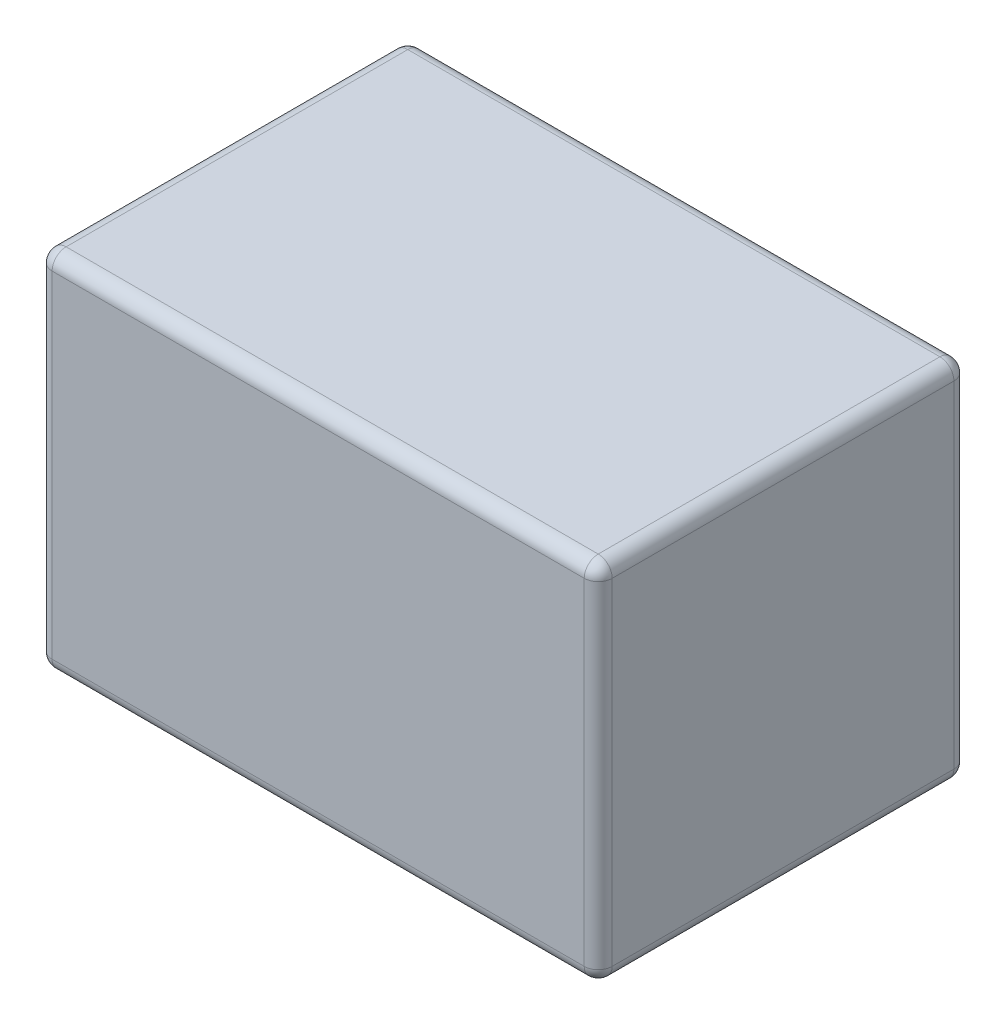
ISO-10303-21;
HEADER;
FILE_DESCRIPTION(('STEP AP214'),'2;1');
FILE_NAME('part.step','',(''),(''),'','','');
FILE_SCHEMA(('AUTOMOTIVE_DESIGN { 1 0 10303 214 1 1 1 1 }'));
ENDSEC;
DATA;
#1=APPLICATION_CONTEXT('core data for automotive mechanical design processes');
#2=APPLICATION_PROTOCOL_DEFINITION('international standard','automotive_design',2000,#1);
#3=PRODUCT_CONTEXT('',#1,'mechanical');
#4=PRODUCT('Part','Part','',(#3));
#5=PRODUCT_RELATED_PRODUCT_CATEGORY('part','',(#4));
#6=PRODUCT_DEFINITION_FORMATION('','',#4);
#7=PRODUCT_DEFINITION_CONTEXT('part definition',#1,'design');
#8=PRODUCT_DEFINITION('design','',#6,#7);
#9=PRODUCT_DEFINITION_SHAPE('','',#8);
#10=(LENGTH_UNIT() NAMED_UNIT(*) SI_UNIT(.MILLI.,.METRE.));
#11=(NAMED_UNIT(*) PLANE_ANGLE_UNIT() SI_UNIT($,.RADIAN.));
#12=(NAMED_UNIT(*) SI_UNIT($,.STERADIAN.) SOLID_ANGLE_UNIT());
#13=UNCERTAINTY_MEASURE_WITH_UNIT(LENGTH_MEASURE(1.E-05),#10,'distance_accuracy_value','');
#14=(GEOMETRIC_REPRESENTATION_CONTEXT(3) GLOBAL_UNCERTAINTY_ASSIGNED_CONTEXT((#13)) GLOBAL_UNIT_ASSIGNED_CONTEXT((#10,
#11,#12)) REPRESENTATION_CONTEXT('',''));
#15=CARTESIAN_POINT('',(0.,0.,0.));
#16=DIRECTION('',(0.,0.,1.));
#17=DIRECTION('',(1.,0.,0.));
#18=AXIS2_PLACEMENT_3D('',#15,#16,#17);
#19=CARTESIAN_POINT('',(0.,45.3224767930072,132.));
#20=DIRECTION('',(0.,1.,0.));
#21=DIRECTION('',(0.,0.,1.));
#22=AXIS2_PLACEMENT_3D('',#19,#20,#21);
#23=PLANE('',#22);
#24=DIRECTION('',(1.,0.,0.));
#25=VECTOR('',#24,1.);
#26=CARTESIAN_POINT('',(-68.5655747312052,45.3224767930072,5.));
#27=LINE('',#26,#25);
#28=CARTESIAN_POINT('',(126.434425268795,45.3224767930072,5.));
#29=VERTEX_POINT('',#28);
#30=CARTESIAN_POINT('',(-63.5655747312052,45.3224767930072,5.));
#31=VERTEX_POINT('',#30);
#32=EDGE_CURVE('E201',#29,#31,#27,.F.);
#33=ORIENTED_EDGE('',*,*,#32,.T.);
#34=DIRECTION('',(0.,0.,-1.));
#35=VECTOR('',#34,1.);
#36=CARTESIAN_POINT('',(-63.5655747312052,45.3224767930072,132.));
#37=LINE('',#36,#35);
#38=CARTESIAN_POINT('',(-63.5655747312052,45.3224767930072,127.));
#39=VERTEX_POINT('',#38);
#40=EDGE_CURVE('E203',#31,#39,#37,.F.);
#41=ORIENTED_EDGE('',*,*,#40,.T.);
#42=DIRECTION('',(1.,0.,0.));
#43=VECTOR('',#42,1.);
#44=CARTESIAN_POINT('',(0.,45.3224767930072,127.));
#45=LINE('',#44,#43);
#46=CARTESIAN_POINT('',(126.434425268795,45.3224767930072,127.));
#47=VERTEX_POINT('',#46);
#48=EDGE_CURVE('E197',#39,#47,#45,.T.);
#49=ORIENTED_EDGE('',*,*,#48,.T.);
#50=DIRECTION('',(0.,0.,-1.));
#51=VECTOR('',#50,1.);
#52=CARTESIAN_POINT('',(126.434425268795,45.3224767930072,132.));
#53=LINE('',#52,#51);
#54=EDGE_CURVE('E199',#47,#29,#53,.T.);
#55=ORIENTED_EDGE('',*,*,#54,.T.);
#56=EDGE_LOOP('',(#33,#41,#49,#55));
#57=FACE_BOUND('',#56,.T.);
#58=ADVANCED_FACE('F35',(#57),#23,.T.);
#59=CARTESIAN_POINT('',(-68.5655747312052,0.,132.));
#60=DIRECTION('',(1.,0.,0.));
#61=DIRECTION('',(0.,1.,0.));
#62=AXIS2_PLACEMENT_3D('',#59,#60,#61);
#63=PLANE('',#62);
#64=DIRECTION('',(0.,-1.,0.));
#65=VECTOR('',#64,1.);
#66=CARTESIAN_POINT('',(-68.5655747312052,0.,5.));
#67=LINE('',#66,#65);
#68=CARTESIAN_POINT('',(-68.5655747312052,40.3224767930072,5.));
#69=VERTEX_POINT('',#68);
#70=CARTESIAN_POINT('',(-68.5655747312052,-79.6775232069929,5.));
#71=VERTEX_POINT('',#70);
#72=EDGE_CURVE('E192',#69,#71,#67,.T.);
#73=ORIENTED_EDGE('',*,*,#72,.T.);
#74=DIRECTION('',(0.,0.,-1.));
#75=VECTOR('',#74,1.);
#76=CARTESIAN_POINT('',(-68.5655747312052,-79.6775232069929,132.));
#77=LINE('',#76,#75);
#78=CARTESIAN_POINT('',(-68.5655747312052,-79.6775232069929,127.));
#79=VERTEX_POINT('',#78);
#80=EDGE_CURVE('E194',#71,#79,#77,.F.);
#81=ORIENTED_EDGE('',*,*,#80,.T.);
#82=DIRECTION('',(0.,-1.,0.));
#83=VECTOR('',#82,1.);
#84=CARTESIAN_POINT('',(-68.5655747312052,45.3224767930072,127.));
#85=LINE('',#84,#83);
#86=CARTESIAN_POINT('',(-68.5655747312052,40.3224767930072,127.));
#87=VERTEX_POINT('',#86);
#88=EDGE_CURVE('E188',#79,#87,#85,.F.);
#89=ORIENTED_EDGE('',*,*,#88,.T.);
#90=DIRECTION('',(0.,0.,-1.));
#91=VECTOR('',#90,1.);
#92=CARTESIAN_POINT('',(-68.5655747312052,40.3224767930072,0.));
#93=LINE('',#92,#91);
#94=EDGE_CURVE('E190',#87,#69,#93,.T.);
#95=ORIENTED_EDGE('',*,*,#94,.T.);
#96=EDGE_LOOP('',(#73,#81,#89,#95));
#97=FACE_BOUND('',#96,.T.);
#98=ADVANCED_FACE('F385',(#97),#63,.F.);
#99=CARTESIAN_POINT('',(0.,-84.6775232069929,132.));
#100=DIRECTION('',(0.,-1.,0.));
#101=DIRECTION('',(1.,0.,0.));
#102=AXIS2_PLACEMENT_3D('',#99,#100,#101);
#103=PLANE('',#102);
#104=DIRECTION('',(0.,0.,-1.));
#105=VECTOR('',#104,1.);
#106=CARTESIAN_POINT('',(-63.5655747312052,-84.6775232069929,0.));
#107=LINE('',#106,#105);
#108=CARTESIAN_POINT('',(-63.5655747312052,-84.6775232069929,127.));
#109=VERTEX_POINT('',#108);
#110=CARTESIAN_POINT('',(-63.5655747312052,-84.6775232069929,5.));
#111=VERTEX_POINT('',#110);
#112=EDGE_CURVE('E183',#109,#111,#107,.T.);
#113=ORIENTED_EDGE('',*,*,#112,.T.);
#114=DIRECTION('',(-1.,0.,0.));
#115=VECTOR('',#114,1.);
#116=CARTESIAN_POINT('',(131.434425268795,-84.6775232069928,5.));
#117=LINE('',#116,#115);
#118=CARTESIAN_POINT('',(126.434425268795,-84.6775232069928,5.));
#119=VERTEX_POINT('',#118);
#120=EDGE_CURVE('E185',#111,#119,#117,.F.);
#121=ORIENTED_EDGE('',*,*,#120,.T.);
#122=DIRECTION('',(0.,0.,-1.));
#123=VECTOR('',#122,1.);
#124=CARTESIAN_POINT('',(126.434425268795,-84.6775232069928,132.));
#125=LINE('',#124,#123);
#126=CARTESIAN_POINT('',(126.434425268795,-84.6775232069928,127.));
#127=VERTEX_POINT('',#126);
#128=EDGE_CURVE('E181',#119,#127,#125,.F.);
#129=ORIENTED_EDGE('',*,*,#128,.T.);
#130=DIRECTION('',(-1.,0.,0.));
#131=VECTOR('',#130,1.);
#132=CARTESIAN_POINT('',(0.,-84.6775232069929,127.));
#133=LINE('',#132,#131);
#134=EDGE_CURVE('E179',#127,#109,#133,.T.);
#135=ORIENTED_EDGE('',*,*,#134,.T.);
#136=EDGE_LOOP('',(#113,#121,#129,#135));
#137=FACE_BOUND('',#136,.T.);
#138=ADVANCED_FACE('F346',(#137),#103,.T.);
#139=CARTESIAN_POINT('',(131.434425268795,0.,132.));
#140=DIRECTION('',(1.,0.,0.));
#141=DIRECTION('',(0.,1.,0.));
#142=AXIS2_PLACEMENT_3D('',#139,#140,#141);
#143=PLANE('',#142);
#144=DIRECTION('',(0.,0.,-1.));
#145=VECTOR('',#144,1.);
#146=CARTESIAN_POINT('',(131.434425268795,-79.6775232069928,132.));
#147=LINE('',#146,#145);
#148=CARTESIAN_POINT('',(131.434425268795,-79.6775232069928,127.));
#149=VERTEX_POINT('',#148);
#150=CARTESIAN_POINT('',(131.434425268795,-79.6775232069928,5.));
#151=VERTEX_POINT('',#150);
#152=EDGE_CURVE('E210',#149,#151,#147,.T.);
#153=ORIENTED_EDGE('',*,*,#152,.T.);
#154=DIRECTION('',(0.,-1.,0.));
#155=VECTOR('',#154,1.);
#156=CARTESIAN_POINT('',(131.434425268795,45.3224767930072,5.));
#157=LINE('',#156,#155);
#158=CARTESIAN_POINT('',(131.434425268795,40.3224767930072,5.));
#159=VERTEX_POINT('',#158);
#160=EDGE_CURVE('E213',#151,#159,#157,.F.);
#161=ORIENTED_EDGE('',*,*,#160,.T.);
#162=DIRECTION('',(0.,0.,-1.));
#163=VECTOR('',#162,1.);
#164=CARTESIAN_POINT('',(131.434425268795,40.3224767930072,132.));
#165=LINE('',#164,#163);
#166=CARTESIAN_POINT('',(131.434425268795,40.3224767930072,127.));
#167=VERTEX_POINT('',#166);
#168=EDGE_CURVE('E208',#159,#167,#165,.F.);
#169=ORIENTED_EDGE('',*,*,#168,.T.);
#170=DIRECTION('',(0.,-1.,0.));
#171=VECTOR('',#170,1.);
#172=CARTESIAN_POINT('',(131.434425268795,0.,127.));
#173=LINE('',#172,#171);
#174=EDGE_CURVE('E206',#167,#149,#173,.T.);
#175=ORIENTED_EDGE('',*,*,#174,.T.);
#176=EDGE_LOOP('',(#153,#161,#169,#175));
#177=FACE_BOUND('',#176,.T.);
#178=ADVANCED_FACE('F312',(#177),#143,.T.);
#179=CARTESIAN_POINT('',(0.,0.,132.));
#180=DIRECTION('',(0.,0.,1.));
#181=DIRECTION('',(1.,0.,0.));
#182=AXIS2_PLACEMENT_3D('',#179,#180,#181);
#183=PLANE('',#182);
#184=DIRECTION('',(-1.,0.,0.));
#185=VECTOR('',#184,1.);
#186=CARTESIAN_POINT('',(0.,-79.6775232069929,132.));
#187=LINE('',#186,#185);
#188=CARTESIAN_POINT('',(-63.5655747312052,-79.6775232069929,132.));
#189=VERTEX_POINT('',#188);
#190=CARTESIAN_POINT('',(126.434425268795,-79.6775232069928,132.));
#191=VERTEX_POINT('',#190);
#192=EDGE_CURVE('E44',#189,#191,#187,.F.);
#193=ORIENTED_EDGE('',*,*,#192,.T.);
#194=DIRECTION('',(0.,-1.,0.));
#195=VECTOR('',#194,1.);
#196=CARTESIAN_POINT('',(126.434425268795,0.,132.));
#197=LINE('',#196,#195);
#198=CARTESIAN_POINT('',(126.434425268795,40.3224767930072,132.));
#199=VERTEX_POINT('',#198);
#200=EDGE_CURVE('E11',#191,#199,#197,.F.);
#201=ORIENTED_EDGE('',*,*,#200,.T.);
#202=DIRECTION('',(1.,0.,0.));
#203=VECTOR('',#202,1.);
#204=CARTESIAN_POINT('',(0.,40.3224767930072,132.));
#205=LINE('',#204,#203);
#206=CARTESIAN_POINT('',(-63.5655747312052,40.3224767930072,132.));
#207=VERTEX_POINT('',#206);
#208=EDGE_CURVE('E215',#199,#207,#205,.F.);
#209=ORIENTED_EDGE('',*,*,#208,.T.);
#210=DIRECTION('',(0.,-1.,0.));
#211=VECTOR('',#210,1.);
#212=CARTESIAN_POINT('',(-63.5655747312052,-84.6775232069929,132.));
#213=LINE('',#212,#211);
#214=EDGE_CURVE('E55',#207,#189,#213,.T.);
#215=ORIENTED_EDGE('',*,*,#214,.T.);
#216=EDGE_LOOP('',(#193,#201,#209,#215));
#217=FACE_BOUND('',#216,.T.);
#218=ADVANCED_FACE('F292',(#217),#183,.T.);
#219=CARTESIAN_POINT('',(0.,40.3224767930072,127.));
#220=DIRECTION('',(1.,0.,0.));
#221=DIRECTION('',(0.,0.,-1.));
#222=AXIS2_PLACEMENT_3D('',#219,#220,#221);
#223=CYLINDRICAL_SURFACE('',#222,5.);
#224=CARTESIAN_POINT('',(126.434425268795,40.3224767930072,127.));
#225=DIRECTION('',(1.,0.,0.));
#226=DIRECTION('',(0.,0.,-1.));
#227=AXIS2_PLACEMENT_3D('',#224,#225,#226);
#228=CIRCLE('',#227,5.);
#229=EDGE_CURVE('E39',#47,#199,#228,.T.);
#230=ORIENTED_EDGE('',*,*,#229,.F.);
#231=ORIENTED_EDGE('',*,*,#48,.F.);
#232=CARTESIAN_POINT('',(-63.5655747312052,40.3224767930072,127.));
#233=DIRECTION('',(-1.,0.,0.));
#234=DIRECTION('',(0.,0.,1.));
#235=AXIS2_PLACEMENT_3D('',#232,#233,#234);
#236=CIRCLE('',#235,5.);
#237=EDGE_CURVE('E275',#207,#39,#236,.T.);
#238=ORIENTED_EDGE('',*,*,#237,.F.);
#239=ORIENTED_EDGE('',*,*,#208,.F.);
#240=EDGE_LOOP('',(#230,#231,#238,#239));
#241=FACE_BOUND('',#240,.T.);
#242=ADVANCED_FACE('F37',(#241),#223,.T.);
#243=CARTESIAN_POINT('',(126.434425268795,40.3224767930072,127.));
#244=DIRECTION('',(0.,0.,1.));
#245=DIRECTION('',(1.,0.,0.));
#246=AXIS2_PLACEMENT_3D('',#243,#244,#245);
#247=SPHERICAL_SURFACE('',#246,5.);
#248=CARTESIAN_POINT('',(126.434425268795,40.3224767930072,127.));
#249=DIRECTION('',(0.,0.,1.));
#250=DIRECTION('',(1.,0.,0.));
#251=AXIS2_PLACEMENT_3D('',#248,#249,#250);
#252=CIRCLE('',#251,5.);
#253=EDGE_CURVE('E271',#47,#167,#252,.F.);
#254=ORIENTED_EDGE('',*,*,#253,.F.);
#255=ORIENTED_EDGE('',*,*,#229,.T.);
#256=CARTESIAN_POINT('',(126.434425268795,40.3224767930072,127.));
#257=DIRECTION('',(0.,1.,0.));
#258=DIRECTION('',(0.,0.,1.));
#259=AXIS2_PLACEMENT_3D('',#256,#257,#258);
#260=CIRCLE('',#259,5.);
#261=EDGE_CURVE('E274',#167,#199,#260,.F.);
#262=ORIENTED_EDGE('',*,*,#261,.F.);
#263=EDGE_LOOP('',(#254,#255,#262));
#264=FACE_BOUND('',#263,.T.);
#265=ADVANCED_FACE('F288',(#264),#247,.T.);
#266=CARTESIAN_POINT('',(-63.5655747312052,40.3224767930072,127.));
#267=DIRECTION('',(0.,1.,0.));
#268=DIRECTION('',(0.,0.,1.));
#269=AXIS2_PLACEMENT_3D('',#266,#267,#268);
#270=SPHERICAL_SURFACE('',#269,5.);
#271=CARTESIAN_POINT('',(-63.5655747312052,40.3224767930072,127.));
#272=DIRECTION('',(0.,1.,0.));
#273=DIRECTION('',(0.,0.,1.));
#274=AXIS2_PLACEMENT_3D('',#271,#272,#273);
#275=CIRCLE('',#274,5.);
#276=EDGE_CURVE('E266',#207,#87,#275,.F.);
#277=ORIENTED_EDGE('',*,*,#276,.F.);
#278=ORIENTED_EDGE('',*,*,#237,.T.);
#279=CARTESIAN_POINT('',(-63.5655747312052,40.3224767930072,127.));
#280=DIRECTION('',(0.,0.,1.));
#281=DIRECTION('',(1.,0.,0.));
#282=AXIS2_PLACEMENT_3D('',#279,#280,#281);
#283=CIRCLE('',#282,5.);
#284=EDGE_CURVE('E269',#87,#39,#283,.F.);
#285=ORIENTED_EDGE('',*,*,#284,.F.);
#286=EDGE_LOOP('',(#277,#278,#285));
#287=FACE_BOUND('',#286,.T.);
#288=ADVANCED_FACE('F332',(#287),#270,.T.);
#289=CARTESIAN_POINT('',(126.434425268795,0.,127.));
#290=DIRECTION('',(0.,-1.,0.));
#291=DIRECTION('',(1.,0.,0.));
#292=AXIS2_PLACEMENT_3D('',#289,#290,#291);
#293=CYLINDRICAL_SURFACE('',#292,5.);
#294=ORIENTED_EDGE('',*,*,#261,.T.);
#295=ORIENTED_EDGE('',*,*,#200,.F.);
#296=CARTESIAN_POINT('',(126.434425268795,-79.6775232069928,127.));
#297=DIRECTION('',(0.,-1.,0.));
#298=DIRECTION('',(0.,0.,-1.));
#299=AXIS2_PLACEMENT_3D('',#296,#297,#298);
#300=CIRCLE('',#299,5.);
#301=EDGE_CURVE('E260',#149,#191,#300,.T.);
#302=ORIENTED_EDGE('',*,*,#301,.F.);
#303=ORIENTED_EDGE('',*,*,#174,.F.);
#304=EDGE_LOOP('',(#294,#295,#302,#303));
#305=FACE_BOUND('',#304,.T.);
#306=ADVANCED_FACE('F296',(#305),#293,.T.);
#307=CARTESIAN_POINT('',(126.434425268795,40.3224767930072,132.));
#308=DIRECTION('',(0.,0.,-1.));
#309=DIRECTION('',(-1.,0.,0.));
#310=AXIS2_PLACEMENT_3D('',#307,#308,#309);
#311=CYLINDRICAL_SURFACE('',#310,5.);
#312=ORIENTED_EDGE('',*,*,#253,.T.);
#313=ORIENTED_EDGE('',*,*,#168,.F.);
#314=CARTESIAN_POINT('',(126.434425268795,40.3224767930072,5.));
#315=DIRECTION('',(0.,0.,-1.));
#316=DIRECTION('',(-1.,0.,0.));
#317=AXIS2_PLACEMENT_3D('',#314,#315,#316);
#318=CIRCLE('',#317,5.);
#319=EDGE_CURVE('E257',#29,#159,#318,.T.);
#320=ORIENTED_EDGE('',*,*,#319,.F.);
#321=ORIENTED_EDGE('',*,*,#54,.F.);
#322=EDGE_LOOP('',(#312,#313,#320,#321));
#323=FACE_BOUND('',#322,.T.);
#324=ADVANCED_FACE('F316',(#323),#311,.T.);
#325=CARTESIAN_POINT('',(0.,40.3224767930072,5.));
#326=DIRECTION('',(-1.,0.,0.));
#327=DIRECTION('',(0.,0.,1.));
#328=AXIS2_PLACEMENT_3D('',#325,#326,#327);
#329=CYLINDRICAL_SURFACE('',#328,5.);
#330=CARTESIAN_POINT('',(-63.5655747312052,40.3224767930072,5.));
#331=DIRECTION('',(-1.,0.,0.));
#332=DIRECTION('',(0.,0.,1.));
#333=AXIS2_PLACEMENT_3D('',#330,#331,#332);
#334=CIRCLE('',#333,5.);
#335=CARTESIAN_POINT('',(-63.5655747312052,40.3224767930072,0.));
#336=VERTEX_POINT('',#335);
#337=EDGE_CURVE('E251',#31,#336,#334,.T.);
#338=ORIENTED_EDGE('',*,*,#337,.F.);
#339=ORIENTED_EDGE('',*,*,#32,.F.);
#340=CARTESIAN_POINT('',(126.434425268795,40.3224767930072,5.));
#341=DIRECTION('',(1.,0.,0.));
#342=DIRECTION('',(0.,0.,-1.));
#343=AXIS2_PLACEMENT_3D('',#340,#341,#342);
#344=CIRCLE('',#343,5.);
#345=CARTESIAN_POINT('',(126.434425268795,40.3224767930072,0.));
#346=VERTEX_POINT('',#345);
#347=EDGE_CURVE('E254',#346,#29,#344,.T.);
#348=ORIENTED_EDGE('',*,*,#347,.F.);
#349=DIRECTION('',(1.,0.,0.));
#350=VECTOR('',#349,1.);
#351=CARTESIAN_POINT('',(131.434425268795,40.3224767930072,0.));
#352=LINE('',#351,#350);
#353=EDGE_CURVE('E160',#336,#346,#352,.T.);
#354=ORIENTED_EDGE('',*,*,#353,.F.);
#355=EDGE_LOOP('',(#338,#339,#348,#354));
#356=FACE_BOUND('',#355,.T.);
#357=ADVANCED_FACE('F322',(#356),#329,.T.);
#358=CARTESIAN_POINT('',(-63.5655747312052,40.3224767930072,132.));
#359=DIRECTION('',(0.,0.,1.));
#360=DIRECTION('',(1.,0.,0.));
#361=AXIS2_PLACEMENT_3D('',#358,#359,#360);
#362=CYLINDRICAL_SURFACE('',#361,5.);
#363=ORIENTED_EDGE('',*,*,#284,.T.);
#364=ORIENTED_EDGE('',*,*,#40,.F.);
#365=CARTESIAN_POINT('',(-63.5655747312052,40.3224767930072,5.));
#366=DIRECTION('',(0.,0.,-1.));
#367=DIRECTION('',(0.,1.,0.));
#368=AXIS2_PLACEMENT_3D('',#365,#366,#367);
#369=CIRCLE('',#368,5.);
#370=EDGE_CURVE('E248',#69,#31,#369,.T.);
#371=ORIENTED_EDGE('',*,*,#370,.F.);
#372=ORIENTED_EDGE('',*,*,#94,.F.);
#373=EDGE_LOOP('',(#363,#364,#371,#372));
#374=FACE_BOUND('',#373,.T.);
#375=ADVANCED_FACE('F331',(#374),#362,.T.);
#376=CARTESIAN_POINT('',(-63.5655747312052,0.,127.));
#377=DIRECTION('',(0.,1.,0.));
#378=DIRECTION('',(-1.,0.,0.));
#379=AXIS2_PLACEMENT_3D('',#376,#377,#378);
#380=CYLINDRICAL_SURFACE('',#379,5.);
#381=ORIENTED_EDGE('',*,*,#276,.T.);
#382=ORIENTED_EDGE('',*,*,#88,.F.);
#383=CARTESIAN_POINT('',(-63.5655747312052,-79.6775232069929,127.));
#384=DIRECTION('',(0.,-1.,0.));
#385=DIRECTION('',(0.,0.,-1.));
#386=AXIS2_PLACEMENT_3D('',#383,#384,#385);
#387=CIRCLE('',#386,5.);
#388=EDGE_CURVE('E245',#189,#79,#387,.T.);
#389=ORIENTED_EDGE('',*,*,#388,.F.);
#390=ORIENTED_EDGE('',*,*,#214,.F.);
#391=EDGE_LOOP('',(#381,#382,#389,#390));
#392=FACE_BOUND('',#391,.T.);
#393=ADVANCED_FACE('F335',(#392),#380,.T.);
#394=CARTESIAN_POINT('',(0.,-79.6775232069929,127.));
#395=DIRECTION('',(-1.,0.,0.));
#396=DIRECTION('',(0.,-1.,0.));
#397=AXIS2_PLACEMENT_3D('',#394,#395,#396);
#398=CYLINDRICAL_SURFACE('',#397,5.);
#399=CARTESIAN_POINT('',(126.434425268795,-79.6775232069928,127.));
#400=DIRECTION('',(1.,0.,0.));
#401=DIRECTION('',(0.,0.,-1.));
#402=AXIS2_PLACEMENT_3D('',#399,#400,#401);
#403=CIRCLE('',#402,5.);
#404=EDGE_CURVE('E263',#191,#127,#403,.T.);
#405=ORIENTED_EDGE('',*,*,#404,.F.);
#406=ORIENTED_EDGE('',*,*,#192,.F.);
#407=CARTESIAN_POINT('',(-63.5655747312052,-79.6775232069929,127.));
#408=DIRECTION('',(-1.,0.,0.));
#409=DIRECTION('',(0.,0.,1.));
#410=AXIS2_PLACEMENT_3D('',#407,#408,#409);
#411=CIRCLE('',#410,5.);
#412=EDGE_CURVE('E242',#109,#189,#411,.T.);
#413=ORIENTED_EDGE('',*,*,#412,.F.);
#414=ORIENTED_EDGE('',*,*,#134,.F.);
#415=EDGE_LOOP('',(#405,#406,#413,#414));
#416=FACE_BOUND('',#415,.T.);
#417=ADVANCED_FACE('F300',(#416),#398,.T.);
#418=CARTESIAN_POINT('',(126.434425268795,-79.6775232069928,127.));
#419=DIRECTION('',(0.,0.,1.));
#420=DIRECTION('',(1.,0.,0.));
#421=AXIS2_PLACEMENT_3D('',#418,#419,#420);
#422=SPHERICAL_SURFACE('',#421,5.);
#423=ORIENTED_EDGE('',*,*,#301,.T.);
#424=ORIENTED_EDGE('',*,*,#404,.T.);
#425=CARTESIAN_POINT('',(126.434425268795,-79.6775232069928,127.));
#426=DIRECTION('',(0.,0.,1.));
#427=DIRECTION('',(1.,0.,0.));
#428=AXIS2_PLACEMENT_3D('',#425,#426,#427);
#429=CIRCLE('',#428,5.);
#430=EDGE_CURVE('E239',#149,#127,#429,.F.);
#431=ORIENTED_EDGE('',*,*,#430,.F.);
#432=EDGE_LOOP('',(#423,#424,#431));
#433=FACE_BOUND('',#432,.T.);
#434=ADVANCED_FACE('F304',(#433),#422,.T.);
#435=CARTESIAN_POINT('',(126.434425268795,40.3224767930072,5.));
#436=DIRECTION('',(0.,1.,0.));
#437=DIRECTION('',(0.,0.,1.));
#438=AXIS2_PLACEMENT_3D('',#435,#436,#437);
#439=SPHERICAL_SURFACE('',#438,5.);
#440=ORIENTED_EDGE('',*,*,#347,.T.);
#441=ORIENTED_EDGE('',*,*,#319,.T.);
#442=CARTESIAN_POINT('',(126.434425268795,40.3224767930072,5.));
#443=DIRECTION('',(0.,1.,0.));
#444=DIRECTION('',(0.,0.,1.));
#445=AXIS2_PLACEMENT_3D('',#442,#443,#444);
#446=CIRCLE('',#445,5.);
#447=EDGE_CURVE('E236',#346,#159,#446,.F.);
#448=ORIENTED_EDGE('',*,*,#447,.F.);
#449=EDGE_LOOP('',(#440,#441,#448));
#450=FACE_BOUND('',#449,.T.);
#451=ADVANCED_FACE('F414',(#450),#439,.T.);
#452=CARTESIAN_POINT('',(-63.5655747312052,40.3224767930072,5.));
#453=DIRECTION('',(0.,1.,0.));
#454=DIRECTION('',(0.,0.,1.));
#455=AXIS2_PLACEMENT_3D('',#452,#453,#454);
#456=SPHERICAL_SURFACE('',#455,5.);
#457=ORIENTED_EDGE('',*,*,#370,.T.);
#458=ORIENTED_EDGE('',*,*,#337,.T.);
#459=CARTESIAN_POINT('',(-63.5655747312052,40.3224767930072,5.));
#460=DIRECTION('',(0.,1.,0.));
#461=DIRECTION('',(0.,0.,1.));
#462=AXIS2_PLACEMENT_3D('',#459,#460,#461);
#463=CIRCLE('',#462,5.);
#464=EDGE_CURVE('E233',#69,#336,#463,.F.);
#465=ORIENTED_EDGE('',*,*,#464,.F.);
#466=EDGE_LOOP('',(#457,#458,#465));
#467=FACE_BOUND('',#466,.T.);
#468=ADVANCED_FACE('F327',(#467),#456,.T.);
#469=CARTESIAN_POINT('',(-63.5655747312052,-79.6775232069929,127.));
#470=DIRECTION('',(0.,0.,1.));
#471=DIRECTION('',(1.,0.,0.));
#472=AXIS2_PLACEMENT_3D('',#469,#470,#471);
#473=SPHERICAL_SURFACE('',#472,5.);
#474=ORIENTED_EDGE('',*,*,#412,.T.);
#475=ORIENTED_EDGE('',*,*,#388,.T.);
#476=CARTESIAN_POINT('',(-63.5655747312052,-79.6775232069929,127.));
#477=DIRECTION('',(0.,0.,1.));
#478=DIRECTION('',(1.,0.,0.));
#479=AXIS2_PLACEMENT_3D('',#476,#477,#478);
#480=CIRCLE('',#479,5.);
#481=EDGE_CURVE('E231',#109,#79,#480,.F.);
#482=ORIENTED_EDGE('',*,*,#481,.F.);
#483=EDGE_LOOP('',(#474,#475,#482));
#484=FACE_BOUND('',#483,.T.);
#485=ADVANCED_FACE('F338',(#484),#473,.T.);
#486=CARTESIAN_POINT('',(126.434425268795,-79.6775232069928,132.));
#487=DIRECTION('',(0.,0.,-1.));
#488=DIRECTION('',(-1.,0.,0.));
#489=AXIS2_PLACEMENT_3D('',#486,#487,#488);
#490=CYLINDRICAL_SURFACE('',#489,5.);
#491=ORIENTED_EDGE('',*,*,#430,.T.);
#492=ORIENTED_EDGE('',*,*,#128,.F.);
#493=CARTESIAN_POINT('',(126.434425268795,-79.6775232069928,5.));
#494=DIRECTION('',(0.,0.,-1.));
#495=DIRECTION('',(-1.,0.,0.));
#496=AXIS2_PLACEMENT_3D('',#493,#494,#495);
#497=CIRCLE('',#496,5.);
#498=EDGE_CURVE('E228',#151,#119,#497,.T.);
#499=ORIENTED_EDGE('',*,*,#498,.F.);
#500=ORIENTED_EDGE('',*,*,#152,.F.);
#501=EDGE_LOOP('',(#491,#492,#499,#500));
#502=FACE_BOUND('',#501,.T.);
#503=ADVANCED_FACE('F309',(#502),#490,.T.);
#504=CARTESIAN_POINT('',(126.434425268795,0.,5.));
#505=DIRECTION('',(0.,1.,0.));
#506=DIRECTION('',(-1.,0.,0.));
#507=AXIS2_PLACEMENT_3D('',#504,#505,#506);
#508=CYLINDRICAL_SURFACE('',#507,5.);
#509=ORIENTED_EDGE('',*,*,#447,.T.);
#510=ORIENTED_EDGE('',*,*,#160,.F.);
#511=CARTESIAN_POINT('',(126.434425268795,-79.6775232069928,5.));
#512=DIRECTION('',(0.,-1.,0.));
#513=DIRECTION('',(0.,0.,-1.));
#514=AXIS2_PLACEMENT_3D('',#511,#512,#513);
#515=CIRCLE('',#514,5.);
#516=CARTESIAN_POINT('',(126.434425268795,-79.6775232069928,0.));
#517=VERTEX_POINT('',#516);
#518=EDGE_CURVE('E226',#517,#151,#515,.T.);
#519=ORIENTED_EDGE('',*,*,#518,.F.);
#520=DIRECTION('',(0.,-1.,0.));
#521=VECTOR('',#520,1.);
#522=CARTESIAN_POINT('',(126.434425268795,-84.6775232069928,0.));
#523=LINE('',#522,#521);
#524=EDGE_CURVE('E170',#346,#517,#523,.T.);
#525=ORIENTED_EDGE('',*,*,#524,.F.);
#526=EDGE_LOOP('',(#509,#510,#519,#525));
#527=FACE_BOUND('',#526,.T.);
#528=ADVANCED_FACE('F404',(#527),#508,.T.);
#529=CARTESIAN_POINT('',(-63.5655747312052,0.,5.));
#530=DIRECTION('',(0.,-1.,0.));
#531=DIRECTION('',(1.,0.,0.));
#532=AXIS2_PLACEMENT_3D('',#529,#530,#531);
#533=CYLINDRICAL_SURFACE('',#532,5.);
#534=ORIENTED_EDGE('',*,*,#464,.T.);
#535=DIRECTION('',(0.,-1.,0.));
#536=VECTOR('',#535,1.);
#537=CARTESIAN_POINT('',(-63.5655747312052,0.,0.));
#538=LINE('',#537,#536);
#539=CARTESIAN_POINT('',(-63.5655747312052,-79.6775232069929,0.));
#540=VERTEX_POINT('',#539);
#541=EDGE_CURVE('E173',#540,#336,#538,.F.);
#542=ORIENTED_EDGE('',*,*,#541,.F.);
#543=CARTESIAN_POINT('',(-63.5655747312052,-79.6775232069929,5.));
#544=DIRECTION('',(0.,-1.,0.));
#545=DIRECTION('',(0.,0.,-1.));
#546=AXIS2_PLACEMENT_3D('',#543,#544,#545);
#547=CIRCLE('',#546,5.);
#548=EDGE_CURVE('E223',#71,#540,#547,.T.);
#549=ORIENTED_EDGE('',*,*,#548,.F.);
#550=ORIENTED_EDGE('',*,*,#72,.F.);
#551=EDGE_LOOP('',(#534,#542,#549,#550));
#552=FACE_BOUND('',#551,.T.);
#553=ADVANCED_FACE('F356',(#552),#533,.T.);
#554=CARTESIAN_POINT('',(-63.5655747312052,-79.6775232069929,132.));
#555=DIRECTION('',(0.,0.,1.));
#556=DIRECTION('',(1.,0.,0.));
#557=AXIS2_PLACEMENT_3D('',#554,#555,#556);
#558=CYLINDRICAL_SURFACE('',#557,5.);
#559=ORIENTED_EDGE('',*,*,#481,.T.);
#560=ORIENTED_EDGE('',*,*,#80,.F.);
#561=CARTESIAN_POINT('',(-63.5655747312052,-79.6775232069929,5.));
#562=DIRECTION('',(0.,0.,-1.));
#563=DIRECTION('',(-1.,0.,0.));
#564=AXIS2_PLACEMENT_3D('',#561,#562,#563);
#565=CIRCLE('',#564,5.);
#566=EDGE_CURVE('E220',#111,#71,#565,.T.);
#567=ORIENTED_EDGE('',*,*,#566,.F.);
#568=ORIENTED_EDGE('',*,*,#112,.F.);
#569=EDGE_LOOP('',(#559,#560,#567,#568));
#570=FACE_BOUND('',#569,.T.);
#571=ADVANCED_FACE('F343',(#570),#558,.T.);
#572=CARTESIAN_POINT('',(126.434425268795,-79.6775232069928,5.));
#573=DIRECTION('',(1.,0.,0.));
#574=DIRECTION('',(0.,0.,-1.));
#575=AXIS2_PLACEMENT_3D('',#572,#573,#574);
#576=SPHERICAL_SURFACE('',#575,5.);
#577=ORIENTED_EDGE('',*,*,#518,.T.);
#578=ORIENTED_EDGE('',*,*,#498,.T.);
#579=CARTESIAN_POINT('',(126.434425268795,-79.6775232069928,5.));
#580=DIRECTION('',(1.,0.,0.));
#581=DIRECTION('',(0.,0.,-1.));
#582=AXIS2_PLACEMENT_3D('',#579,#580,#581);
#583=CIRCLE('',#582,5.);
#584=EDGE_CURVE('E164',#517,#119,#583,.F.);
#585=ORIENTED_EDGE('',*,*,#584,.F.);
#586=EDGE_LOOP('',(#577,#578,#585));
#587=FACE_BOUND('',#586,.T.);
#588=ADVANCED_FACE('F396',(#587),#576,.T.);
#589=CARTESIAN_POINT('',(-63.5655747312052,-79.6775232069929,5.));
#590=DIRECTION('',(-1.,0.,0.));
#591=DIRECTION('',(0.,0.,1.));
#592=AXIS2_PLACEMENT_3D('',#589,#590,#591);
#593=SPHERICAL_SURFACE('',#592,5.);
#594=ORIENTED_EDGE('',*,*,#566,.T.);
#595=ORIENTED_EDGE('',*,*,#548,.T.);
#596=CARTESIAN_POINT('',(-63.5655747312052,-79.6775232069929,5.));
#597=DIRECTION('',(-1.,0.,0.));
#598=DIRECTION('',(0.,0.,1.));
#599=AXIS2_PLACEMENT_3D('',#596,#597,#598);
#600=CIRCLE('',#599,5.);
#601=EDGE_CURVE('E161',#111,#540,#600,.F.);
#602=ORIENTED_EDGE('',*,*,#601,.F.);
#603=EDGE_LOOP('',(#594,#595,#602));
#604=FACE_BOUND('',#603,.T.);
#605=ADVANCED_FACE('F353',(#604),#593,.T.);
#606=CARTESIAN_POINT('',(0.,-79.6775232069929,5.));
#607=DIRECTION('',(1.,0.,0.));
#608=DIRECTION('',(0.,1.,0.));
#609=AXIS2_PLACEMENT_3D('',#606,#607,#608);
#610=CYLINDRICAL_SURFACE('',#609,5.);
#611=ORIENTED_EDGE('',*,*,#584,.T.);
#612=ORIENTED_EDGE('',*,*,#120,.F.);
#613=ORIENTED_EDGE('',*,*,#601,.T.);
#614=DIRECTION('',(-1.,0.,0.));
#615=VECTOR('',#614,1.);
#616=CARTESIAN_POINT('',(-68.5655747312052,-79.6775232069929,0.));
#617=LINE('',#616,#615);
#618=EDGE_CURVE('E176',#517,#540,#617,.T.);
#619=ORIENTED_EDGE('',*,*,#618,.F.);
#620=EDGE_LOOP('',(#611,#612,#613,#619));
#621=FACE_BOUND('',#620,.T.);
#622=ADVANCED_FACE('F349',(#621),#610,.T.);
#623=CARTESIAN_POINT('',(0.,0.,-0.5));
#624=DIRECTION('',(0.,0.,-1.));
#625=DIRECTION('',(-1.,0.,0.));
#626=AXIS2_PLACEMENT_3D('',#623,#624,#625);
#627=PLANE('',#626);
#628=DIRECTION('',(1.,0.,0.));
#629=VECTOR('',#628,1.);
#630=CARTESIAN_POINT('',(-63.5655747312052,40.3224767930072,-0.5));
#631=LINE('',#630,#629);
#632=CARTESIAN_POINT('',(-63.5655747312052,40.3224767930072,-0.5));
#633=VERTEX_POINT('',#632);
#634=CARTESIAN_POINT('',(126.434425268795,40.3224767930072,-0.5));
#635=VERTEX_POINT('',#634);
#636=EDGE_CURVE('E147',#633,#635,#631,.T.);
#637=ORIENTED_EDGE('',*,*,#636,.T.);
#638=DIRECTION('',(0.,-1.,0.));
#639=VECTOR('',#638,1.);
#640=CARTESIAN_POINT('',(126.434425268795,40.3224767930072,-0.5));
#641=LINE('',#640,#639);
#642=CARTESIAN_POINT('',(126.434425268795,-79.6775232069928,-0.5));
#643=VERTEX_POINT('',#642);
#644=EDGE_CURVE('E135',#635,#643,#641,.T.);
#645=ORIENTED_EDGE('',*,*,#644,.T.);
#646=DIRECTION('',(-1.,0.,0.));
#647=VECTOR('',#646,1.);
#648=CARTESIAN_POINT('',(126.434425268795,-79.6775232069928,-0.5));
#649=LINE('',#648,#647);
#650=CARTESIAN_POINT('',(-63.5655747312052,-79.6775232069929,-0.5));
#651=VERTEX_POINT('',#650);
#652=EDGE_CURVE('E146',#643,#651,#649,.T.);
#653=ORIENTED_EDGE('',*,*,#652,.T.);
#654=DIRECTION('',(0.,1.,0.));
#655=VECTOR('',#654,1.);
#656=CARTESIAN_POINT('',(-63.5655747312052,-79.6775232069929,-0.5));
#657=LINE('',#656,#655);
#658=EDGE_CURVE('E153',#651,#633,#657,.T.);
#659=ORIENTED_EDGE('',*,*,#658,.T.);
#660=EDGE_LOOP('',(#637,#645,#653,#659));
#661=FACE_BOUND('',#660,.T.);
#662=CARTESIAN_POINT('',(31.4344252687948,-19.6775232069928,-0.5));
#663=DIRECTION('',(0.,0.,-1.));
#664=DIRECTION('',(-1.,0.,0.));
#665=AXIS2_PLACEMENT_3D('',#662,#663,#664);
#666=CIRCLE('',#665,0.25);
#667=CARTESIAN_POINT('',(31.1844252687948,-19.6775232069928,-0.5));
#668=VERTEX_POINT('',#667);
#669=EDGE_CURVE('E157',#668,#668,#666,.T.);
#670=ORIENTED_EDGE('',*,*,#669,.F.);
#671=EDGE_LOOP('',(#670));
#672=FACE_BOUND('',#671,.T.);
#673=ADVANCED_FACE('F150',(#661,#672),#627,.T.);
#674=CARTESIAN_POINT('',(-63.5655747312052,40.3224767930072,-0.5));
#675=DIRECTION('',(0.,-1.,0.));
#676=DIRECTION('',(0.,0.,-1.));
#677=AXIS2_PLACEMENT_3D('',#674,#675,#676);
#678=PLANE('',#677);
#679=ORIENTED_EDGE('',*,*,#353,.T.);
#680=DIRECTION('',(0.,0.,1.));
#681=VECTOR('',#680,1.);
#682=CARTESIAN_POINT('',(126.434425268795,40.3224767930072,-0.5));
#683=LINE('',#682,#681);
#684=EDGE_CURVE('E140',#635,#346,#683,.T.);
#685=ORIENTED_EDGE('',*,*,#684,.F.);
#686=ORIENTED_EDGE('',*,*,#636,.F.);
#687=DIRECTION('',(0.,0.,1.));
#688=VECTOR('',#687,1.);
#689=CARTESIAN_POINT('',(-63.5655747312052,40.3224767930072,-0.5));
#690=LINE('',#689,#688);
#691=EDGE_CURVE('E360',#633,#336,#690,.T.);
#692=ORIENTED_EDGE('',*,*,#691,.T.);
#693=EDGE_LOOP('',(#679,#685,#686,#692));
#694=FACE_BOUND('',#693,.T.);
#695=ADVANCED_FACE('F159',(#694),#678,.F.);
#696=CARTESIAN_POINT('',(126.434425268795,40.3224767930072,-0.5));
#697=DIRECTION('',(-1.,0.,0.));
#698=DIRECTION('',(0.,-1.,0.));
#699=AXIS2_PLACEMENT_3D('',#696,#697,#698);
#700=PLANE('',#699);
#701=ORIENTED_EDGE('',*,*,#524,.T.);
#702=DIRECTION('',(0.,0.,1.));
#703=VECTOR('',#702,1.);
#704=CARTESIAN_POINT('',(126.434425268795,-79.6775232069928,-0.5));
#705=LINE('',#704,#703);
#706=EDGE_CURVE('E143',#643,#517,#705,.T.);
#707=ORIENTED_EDGE('',*,*,#706,.F.);
#708=ORIENTED_EDGE('',*,*,#644,.F.);
#709=ORIENTED_EDGE('',*,*,#684,.T.);
#710=EDGE_LOOP('',(#701,#707,#708,#709));
#711=FACE_BOUND('',#710,.T.);
#712=ADVANCED_FACE('F138',(#711),#700,.F.);
#713=CARTESIAN_POINT('',(126.434425268795,-79.6775232069928,-0.5));
#714=DIRECTION('',(0.,1.,0.));
#715=DIRECTION('',(-1.,0.,0.));
#716=AXIS2_PLACEMENT_3D('',#713,#714,#715);
#717=PLANE('',#716);
#718=ORIENTED_EDGE('',*,*,#618,.T.);
#719=DIRECTION('',(0.,0.,1.));
#720=VECTOR('',#719,1.);
#721=CARTESIAN_POINT('',(-63.5655747312052,-79.6775232069929,-0.5));
#722=LINE('',#721,#720);
#723=EDGE_CURVE('E166',#651,#540,#722,.T.);
#724=ORIENTED_EDGE('',*,*,#723,.F.);
#725=ORIENTED_EDGE('',*,*,#652,.F.);
#726=ORIENTED_EDGE('',*,*,#706,.T.);
#727=EDGE_LOOP('',(#718,#724,#725,#726));
#728=FACE_BOUND('',#727,.T.);
#729=ADVANCED_FACE('F599',(#728),#717,.F.);
#730=CARTESIAN_POINT('',(-63.5655747312052,-79.6775232069929,-0.5));
#731=DIRECTION('',(1.,0.,0.));
#732=DIRECTION('',(0.,1.,0.));
#733=AXIS2_PLACEMENT_3D('',#730,#731,#732);
#734=PLANE('',#733);
#735=ORIENTED_EDGE('',*,*,#541,.T.);
#736=ORIENTED_EDGE('',*,*,#691,.F.);
#737=ORIENTED_EDGE('',*,*,#658,.F.);
#738=ORIENTED_EDGE('',*,*,#723,.T.);
#739=EDGE_LOOP('',(#735,#736,#737,#738));
#740=FACE_BOUND('',#739,.T.);
#741=ADVANCED_FACE('F359',(#740),#734,.F.);
#742=CARTESIAN_POINT('',(31.4344252687948,-19.6775232069928,-0.5));
#743=DIRECTION('',(0.,0.,1.));
#744=DIRECTION('',(1.,0.,0.));
#745=AXIS2_PLACEMENT_3D('',#742,#743,#744);
#746=CYLINDRICAL_SURFACE('',#745,0.25);
#747=ORIENTED_EDGE('',*,*,#669,.T.);
#748=EDGE_LOOP('',(#747));
#749=FACE_BOUND('',#748,.T.);
#750=CARTESIAN_POINT('',(31.4344252687948,-19.6775232069928,0.));
#751=DIRECTION('',(0.,0.,-1.));
#752=DIRECTION('',(-1.,0.,0.));
#753=AXIS2_PLACEMENT_3D('',#750,#751,#752);
#754=CIRCLE('',#753,0.25);
#755=CARTESIAN_POINT('',(31.1844252687948,-19.6775232069928,0.));
#756=VERTEX_POINT('',#755);
#757=EDGE_CURVE('E366',#756,#756,#754,.T.);
#758=ORIENTED_EDGE('',*,*,#757,.F.);
#759=EDGE_LOOP('',(#758));
#760=FACE_BOUND('',#759,.T.);
#761=ADVANCED_FACE('F372',(#749,#760),#746,.F.);
#762=CARTESIAN_POINT('',(0.,0.,0.));
#763=DIRECTION('',(0.,0.,1.));
#764=DIRECTION('',(1.,0.,0.));
#765=AXIS2_PLACEMENT_3D('',#762,#763,#764);
#766=PLANE('',#765);
#767=ORIENTED_EDGE('',*,*,#757,.T.);
#768=EDGE_LOOP('',(#767));
#769=FACE_BOUND('',#768,.T.);
#770=ADVANCED_FACE('F447',(#769),#766,.F.);
#771=CLOSED_SHELL('',(#58,#98,#138,#178,#218,#242,#265,#288,#306,#324,#357,#375,#393,#417,#434,
#451,#468,#485,#503,#528,#553,#571,#588,#605,#622,#673,#695,#712,#729,#741,#761,#770));
#772=MANIFOLD_SOLID_BREP('B2',#771);
#773=ADVANCED_BREP_SHAPE_REPRESENTATION('',(#18,#772),#14);
#774=SHAPE_DEFINITION_REPRESENTATION(#9,#773);
ENDSEC;
END-ISO-10303-21;
